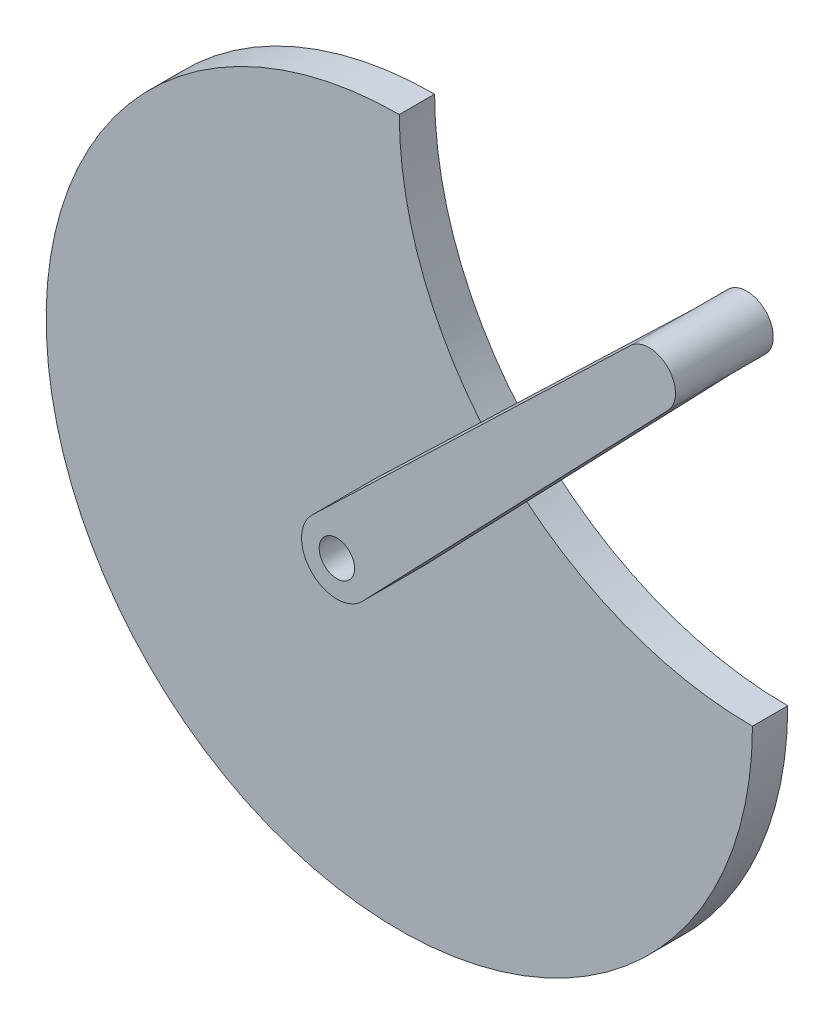
ISO-10303-21;
HEADER;
FILE_DESCRIPTION(('STEP AP214'),'2;1');
FILE_NAME('part.step','',(''),(''),'','','');
FILE_SCHEMA(('AUTOMOTIVE_DESIGN { 1 0 10303 214 1 1 1 1 }'));
ENDSEC;
DATA;
#1=APPLICATION_CONTEXT('core data for automotive mechanical design processes');
#2=APPLICATION_PROTOCOL_DEFINITION('international standard','automotive_design',2000,#1);
#3=PRODUCT_CONTEXT('',#1,'mechanical');
#4=PRODUCT('Part','Part','',(#3));
#5=PRODUCT_RELATED_PRODUCT_CATEGORY('part','',(#4));
#6=PRODUCT_DEFINITION_FORMATION('','',#4);
#7=PRODUCT_DEFINITION_CONTEXT('part definition',#1,'design');
#8=PRODUCT_DEFINITION('design','',#6,#7);
#9=PRODUCT_DEFINITION_SHAPE('','',#8);
#10=(LENGTH_UNIT() NAMED_UNIT(*) SI_UNIT(.MILLI.,.METRE.));
#11=(NAMED_UNIT(*) PLANE_ANGLE_UNIT() SI_UNIT($,.RADIAN.));
#12=(NAMED_UNIT(*) SI_UNIT($,.STERADIAN.) SOLID_ANGLE_UNIT());
#13=UNCERTAINTY_MEASURE_WITH_UNIT(LENGTH_MEASURE(1.E-05),#10,'distance_accuracy_value','');
#14=(GEOMETRIC_REPRESENTATION_CONTEXT(3) GLOBAL_UNCERTAINTY_ASSIGNED_CONTEXT((#13)) GLOBAL_UNIT_ASSIGNED_CONTEXT((#10,
#11,#12)) REPRESENTATION_CONTEXT('',''));
#15=CARTESIAN_POINT('',(0.,0.,0.));
#16=DIRECTION('',(0.,0.,1.));
#17=DIRECTION('',(1.,0.,0.));
#18=AXIS2_PLACEMENT_3D('',#15,#16,#17);
#19=CARTESIAN_POINT('',(-7.81766235091372,10.1823376490863,-1.01823376490863));
#20=DIRECTION('',(0.,0.,1.));
#21=DIRECTION('',(1.,0.,0.));
#22=AXIS2_PLACEMENT_3D('',#19,#20,#21);
#23=CYLINDRICAL_SURFACE('',#22,10.1823376490863);
#24=CARTESIAN_POINT('',(-7.81766235091372,10.1823376490863,0.));
#25=DIRECTION('',(0.,0.,1.));
#26=DIRECTION('',(1.,0.,0.));
#27=AXIS2_PLACEMENT_3D('',#24,#25,#26);
#28=CIRCLE('',#27,10.1823376490863);
#29=CARTESIAN_POINT('',(-7.81766235091371,0.,0.));
#30=VERTEX_POINT('',#29);
#31=CARTESIAN_POINT('',(-14.3274804750982,2.35276116053727,0.));
#32=VERTEX_POINT('',#31);
#33=EDGE_CURVE('E243',#30,#32,#28,.F.);
#34=ORIENTED_EDGE('',*,*,#33,.F.);
#35=DIRECTION('',(0.,0.,1.));
#36=VECTOR('',#35,1.);
#37=CARTESIAN_POINT('',(-7.81766235091371,0.,-1.01823376490863));
#38=LINE('',#37,#36);
#39=CARTESIAN_POINT('',(-7.81766235091371,0.,-1.01823376490863));
#40=VERTEX_POINT('',#39);
#41=EDGE_CURVE('E52',#40,#30,#38,.T.);
#42=ORIENTED_EDGE('',*,*,#41,.F.);
#43=CARTESIAN_POINT('',(-7.81766235091372,10.1823376490863,-1.01823376490863));
#44=DIRECTION('',(0.,0.,1.));
#45=DIRECTION('',(1.,0.,0.));
#46=AXIS2_PLACEMENT_3D('',#43,#44,#45);
#47=CIRCLE('',#46,10.1823376490863);
#48=CARTESIAN_POINT('',(-18.,10.1823376490863,-1.01823376490863));
#49=VERTEX_POINT('',#48);
#50=EDGE_CURVE('E233',#40,#49,#47,.F.);
#51=ORIENTED_EDGE('',*,*,#50,.T.);
#52=DIRECTION('',(0.,0.,1.));
#53=VECTOR('',#52,1.);
#54=CARTESIAN_POINT('',(-18.,10.1823376490863,-1.01823376490863));
#55=LINE('',#54,#53);
#56=CARTESIAN_POINT('',(-18.,10.1823376490863,0.));
#57=VERTEX_POINT('',#56);
#58=EDGE_CURVE('E47',#49,#57,#55,.T.);
#59=ORIENTED_EDGE('',*,*,#58,.T.);
#60=CARTESIAN_POINT('',(-15.6472388394627,3.67251952490181,0.));
#61=VERTEX_POINT('',#60);
#62=EDGE_CURVE('E232',#61,#57,#28,.F.);
#63=ORIENTED_EDGE('',*,*,#62,.F.);
#64=EDGE_CURVE('E245',#32,#61,#28,.F.);
#65=ORIENTED_EDGE('',*,*,#64,.F.);
#66=EDGE_LOOP('',(#34,#42,#51,#59,#63,#65));
#67=FACE_BOUND('',#66,.T.);
#68=ADVANCED_FACE('F44',(#67),#23,.F.);
#69=CARTESIAN_POINT('',(-18.,0.,-1.01823376490863));
#70=DIRECTION('',(0.,0.,1.));
#71=DIRECTION('',(1.,0.,0.));
#72=AXIS2_PLACEMENT_3D('',#69,#70,#71);
#73=CYLINDRICAL_SURFACE('',#72,10.1823376490863);
#74=CARTESIAN_POINT('',(-18.,0.,0.));
#75=DIRECTION('',(0.,0.,1.));
#76=DIRECTION('',(1.,0.,0.));
#77=AXIS2_PLACEMENT_3D('',#74,#75,#76);
#78=CIRCLE('',#77,10.1823376490863);
#79=EDGE_CURVE('E237',#57,#30,#78,.T.);
#80=ORIENTED_EDGE('',*,*,#79,.F.);
#81=ORIENTED_EDGE('',*,*,#58,.F.);
#82=CARTESIAN_POINT('',(-18.,0.,-1.01823376490863));
#83=DIRECTION('',(0.,0.,1.));
#84=DIRECTION('',(1.,0.,0.));
#85=AXIS2_PLACEMENT_3D('',#82,#83,#84);
#86=CIRCLE('',#85,10.1823376490863);
#87=EDGE_CURVE('E236',#49,#40,#86,.T.);
#88=ORIENTED_EDGE('',*,*,#87,.T.);
#89=ORIENTED_EDGE('',*,*,#41,.T.);
#90=EDGE_LOOP('',(#80,#81,#88,#89));
#91=FACE_BOUND('',#90,.T.);
#92=ADVANCED_FACE('F257',(#91),#73,.T.);
#93=CARTESIAN_POINT('',(-18.,0.,-1.01823376490863));
#94=DIRECTION('',(0.,0.,1.));
#95=DIRECTION('',(1.,0.,0.));
#96=AXIS2_PLACEMENT_3D('',#93,#94,#95);
#97=CYLINDRICAL_SURFACE('',#96,0.509116882454314);
#98=CARTESIAN_POINT('',(-18.,0.,-1.01823376490863));
#99=DIRECTION('',(0.,0.,1.));
#100=DIRECTION('',(1.,0.,0.));
#101=AXIS2_PLACEMENT_3D('',#98,#99,#100);
#102=CIRCLE('',#101,0.509116882454314);
#103=CARTESIAN_POINT('',(-17.4908831175457,0.,-1.01823376490863));
#104=VERTEX_POINT('',#103);
#105=EDGE_CURVE('E240',#104,#104,#102,.T.);
#106=ORIENTED_EDGE('',*,*,#105,.F.);
#107=EDGE_LOOP('',(#106));
#108=FACE_BOUND('',#107,.T.);
#109=CARTESIAN_POINT('',(-18.,0.,1.8));
#110=DIRECTION('',(0.,0.,1.));
#111=DIRECTION('',(1.,0.,0.));
#112=AXIS2_PLACEMENT_3D('',#109,#110,#111);
#113=CIRCLE('',#112,0.509116882454314);
#114=CARTESIAN_POINT('',(-17.4908831175457,0.,1.8));
#115=VERTEX_POINT('',#114);
#116=EDGE_CURVE('E195',#115,#115,#113,.T.);
#117=ORIENTED_EDGE('',*,*,#116,.T.);
#118=EDGE_LOOP('',(#117));
#119=FACE_BOUND('',#118,.T.);
#120=ADVANCED_FACE('F287',(#108,#119),#97,.F.);
#121=CARTESIAN_POINT('',(0.,0.,-1.01823376490863));
#122=DIRECTION('',(0.,0.,1.));
#123=DIRECTION('',(1.,0.,0.));
#124=AXIS2_PLACEMENT_3D('',#121,#122,#123);
#125=PLANE('',#124);
#126=ORIENTED_EDGE('',*,*,#50,.F.);
#127=ORIENTED_EDGE('',*,*,#87,.F.);
#128=EDGE_LOOP('',(#126,#127));
#129=FACE_BOUND('',#128,.T.);
#130=ORIENTED_EDGE('',*,*,#105,.T.);
#131=EDGE_LOOP('',(#130));
#132=FACE_BOUND('',#131,.T.);
#133=ADVANCED_FACE('F289',(#129,#132),#125,.F.);
#134=CARTESIAN_POINT('',(0.,0.,0.));
#135=DIRECTION('',(0.,0.,1.));
#136=DIRECTION('',(1.,0.,0.));
#137=AXIS2_PLACEMENT_3D('',#134,#135,#136);
#138=PLANE('',#137);
#139=DIRECTION('',(-0.721107481309078,-0.692823210061613,0.));
#140=VECTOR('',#139,1.);
#141=CARTESIAN_POINT('',(-9.5290919891978,9.55069198919783,0.));
#142=LINE('',#141,#140);
#143=CARTESIAN_POINT('',(-18.7054559855971,0.734255985597119,0.));
#144=VERTEX_POINT('',#143);
#145=EDGE_CURVE('E12',#61,#144,#142,.T.);
#146=ORIENTED_EDGE('',*,*,#145,.F.);
#147=ORIENTED_EDGE('',*,*,#62,.T.);
#148=ORIENTED_EDGE('',*,*,#79,.T.);
#149=ORIENTED_EDGE('',*,*,#33,.T.);
#150=DIRECTION('',(0.692823210061616,0.721107481309075,0.));
#151=VECTOR('',#150,1.);
#152=CARTESIAN_POINT('',(-17.2657440144029,-0.705455985597122,0.));
#153=LINE('',#152,#151);
#154=CARTESIAN_POINT('',(-17.2657440144029,-0.705455985597122,0.));
#155=VERTEX_POINT('',#154);
#156=EDGE_CURVE('E217',#155,#32,#153,.T.);
#157=ORIENTED_EDGE('',*,*,#156,.F.);
#158=CARTESIAN_POINT('',(-18.,0.,0.));
#159=DIRECTION('',(0.,0.,1.));
#160=DIRECTION('',(1.,0.,0.));
#161=AXIS2_PLACEMENT_3D('',#158,#159,#160);
#162=CIRCLE('',#161,1.01823376490863);
#163=EDGE_CURVE('E69',#144,#155,#162,.T.);
#164=ORIENTED_EDGE('',*,*,#163,.F.);
#165=EDGE_LOOP('',(#146,#147,#148,#149,#157,#164));
#166=FACE_BOUND('',#165,.T.);
#167=ADVANCED_FACE('F258',(#166),#138,.T.);
#168=CARTESIAN_POINT('',(-18.,0.,0.));
#169=DIRECTION('',(0.,0.,1.));
#170=DIRECTION('',(1.,0.,0.));
#171=AXIS2_PLACEMENT_3D('',#168,#169,#170);
#172=PLANE('',#171);
#173=CARTESIAN_POINT('',(-9.5290919891978,9.55069198919784,0.));
#174=VERTEX_POINT('',#173);
#175=EDGE_CURVE('E54',#174,#61,#142,.T.);
#176=ORIENTED_EDGE('',*,*,#175,.F.);
#177=CARTESIAN_POINT('',(-8.99999999999997,8.99999999999999,0.));
#178=DIRECTION('',(0.,0.,1.));
#179=DIRECTION('',(1.,0.,0.));
#180=AXIS2_PLACEMENT_3D('',#177,#178,#179);
#181=CIRCLE('',#180,0.763675323681471);
#182=CARTESIAN_POINT('',(-8.44930801080213,8.47090801080215,0.));
#183=VERTEX_POINT('',#182);
#184=EDGE_CURVE('E160',#174,#183,#181,.T.);
#185=ORIENTED_EDGE('',*,*,#184,.T.);
#186=EDGE_CURVE('E216',#32,#183,#153,.T.);
#187=ORIENTED_EDGE('',*,*,#186,.F.);
#188=ORIENTED_EDGE('',*,*,#64,.T.);
#189=EDGE_LOOP('',(#176,#185,#187,#188));
#190=FACE_BOUND('',#189,.T.);
#191=ADVANCED_FACE('F262',(#190),#172,.F.);
#192=CARTESIAN_POINT('',(-18.,0.,1.8));
#193=DIRECTION('',(0.,0.,1.));
#194=DIRECTION('',(1.,0.,0.));
#195=AXIS2_PLACEMENT_3D('',#192,#193,#194);
#196=PLANE('',#195);
#197=CARTESIAN_POINT('',(-18.,0.,1.8));
#198=DIRECTION('',(0.,0.,1.));
#199=DIRECTION('',(1.,0.,0.));
#200=AXIS2_PLACEMENT_3D('',#197,#198,#199);
#201=CIRCLE('',#200,1.01823376490863);
#202=CARTESIAN_POINT('',(-18.7054559855971,0.734255985597119,1.8));
#203=VERTEX_POINT('',#202);
#204=CARTESIAN_POINT('',(-17.2657440144029,-0.705455985597122,1.8));
#205=VERTEX_POINT('',#204);
#206=EDGE_CURVE('E205',#203,#205,#201,.T.);
#207=ORIENTED_EDGE('',*,*,#206,.T.);
#208=DIRECTION('',(0.692823210061616,0.721107481309075,0.));
#209=VECTOR('',#208,1.);
#210=CARTESIAN_POINT('',(-17.2657440144029,-0.705455985597122,1.8));
#211=LINE('',#210,#209);
#212=CARTESIAN_POINT('',(-8.44930801080213,8.47090801080215,1.8));
#213=VERTEX_POINT('',#212);
#214=EDGE_CURVE('E208',#205,#213,#211,.T.);
#215=ORIENTED_EDGE('',*,*,#214,.T.);
#216=CARTESIAN_POINT('',(-8.99999999999997,8.99999999999999,1.8));
#217=DIRECTION('',(0.,0.,1.));
#218=DIRECTION('',(1.,0.,0.));
#219=AXIS2_PLACEMENT_3D('',#216,#217,#218);
#220=CIRCLE('',#219,0.763675323681471);
#221=CARTESIAN_POINT('',(-9.5290919891978,9.55069198919784,1.8));
#222=VERTEX_POINT('',#221);
#223=EDGE_CURVE('E210',#213,#222,#220,.T.);
#224=ORIENTED_EDGE('',*,*,#223,.T.);
#225=DIRECTION('',(-0.721107481309078,-0.692823210061613,0.));
#226=VECTOR('',#225,1.);
#227=CARTESIAN_POINT('',(-9.5290919891978,9.55069198919783,1.8));
#228=LINE('',#227,#226);
#229=EDGE_CURVE('E212',#222,#203,#228,.T.);
#230=ORIENTED_EDGE('',*,*,#229,.T.);
#231=EDGE_LOOP('',(#207,#215,#224,#230));
#232=FACE_BOUND('',#231,.T.);
#233=ORIENTED_EDGE('',*,*,#116,.F.);
#234=EDGE_LOOP('',(#233));
#235=FACE_BOUND('',#234,.T.);
#236=ADVANCED_FACE('F281',(#232,#235),#196,.T.);
#237=CARTESIAN_POINT('',(-18.,0.,1.8));
#238=DIRECTION('',(0.,0.,-1.));
#239=DIRECTION('',(-1.,0.,0.));
#240=AXIS2_PLACEMENT_3D('',#237,#238,#239);
#241=CYLINDRICAL_SURFACE('',#240,1.01823376490863);
#242=ORIENTED_EDGE('',*,*,#163,.T.);
#243=DIRECTION('',(0.,0.,-1.));
#244=VECTOR('',#243,1.);
#245=CARTESIAN_POINT('',(-17.2657440144029,-0.705455985597122,1.8));
#246=LINE('',#245,#244);
#247=EDGE_CURVE('E229',#205,#155,#246,.T.);
#248=ORIENTED_EDGE('',*,*,#247,.F.);
#249=ORIENTED_EDGE('',*,*,#206,.F.);
#250=DIRECTION('',(0.,0.,-1.));
#251=VECTOR('',#250,1.);
#252=CARTESIAN_POINT('',(-18.7054559855971,0.734255985597119,1.8));
#253=LINE('',#252,#251);
#254=EDGE_CURVE('E214',#203,#144,#253,.T.);
#255=ORIENTED_EDGE('',*,*,#254,.T.);
#256=EDGE_LOOP('',(#242,#248,#249,#255));
#257=FACE_BOUND('',#256,.T.);
#258=ADVANCED_FACE('F279',(#257),#241,.T.);
#259=CARTESIAN_POINT('',(-17.2657440144029,-0.705455985597122,1.8));
#260=DIRECTION('',(-0.721107481309075,0.692823210061616,0.));
#261=DIRECTION('',(-0.692823210061616,-0.721107481309075,0.));
#262=AXIS2_PLACEMENT_3D('',#259,#260,#261);
#263=PLANE('',#262);
#264=ORIENTED_EDGE('',*,*,#156,.T.);
#265=ORIENTED_EDGE('',*,*,#186,.T.);
#266=DIRECTION('',(0.,0.,-1.));
#267=VECTOR('',#266,1.);
#268=CARTESIAN_POINT('',(-8.44930801080213,8.47090801080215,1.8));
#269=LINE('',#268,#267);
#270=EDGE_CURVE('E226',#213,#183,#269,.T.);
#271=ORIENTED_EDGE('',*,*,#270,.F.);
#272=ORIENTED_EDGE('',*,*,#214,.F.);
#273=ORIENTED_EDGE('',*,*,#247,.T.);
#274=EDGE_LOOP('',(#264,#265,#271,#272,#273));
#275=FACE_BOUND('',#274,.T.);
#276=ADVANCED_FACE('F275',(#275),#263,.F.);
#277=CARTESIAN_POINT('',(-8.99999999999997,8.99999999999999,1.8));
#278=DIRECTION('',(0.,0.,-1.));
#279=DIRECTION('',(-1.,0.,0.));
#280=AXIS2_PLACEMENT_3D('',#277,#278,#279);
#281=CYLINDRICAL_SURFACE('',#280,0.763675323681471);
#282=ORIENTED_EDGE('',*,*,#270,.T.);
#283=ORIENTED_EDGE('',*,*,#184,.F.);
#284=DIRECTION('',(0.,0.,-1.));
#285=VECTOR('',#284,1.);
#286=CARTESIAN_POINT('',(-9.5290919891978,9.55069198919784,1.8));
#287=LINE('',#286,#285);
#288=EDGE_CURVE('E223',#222,#174,#287,.T.);
#289=ORIENTED_EDGE('',*,*,#288,.F.);
#290=ORIENTED_EDGE('',*,*,#223,.F.);
#291=EDGE_LOOP('',(#282,#283,#289,#290));
#292=FACE_BOUND('',#291,.T.);
#293=CARTESIAN_POINT('',(-8.99999999999997,8.99999999999999,-1.01823376490863));
#294=DIRECTION('',(0.,0.,1.));
#295=DIRECTION('',(1.,0.,0.));
#296=AXIS2_PLACEMENT_3D('',#293,#294,#295);
#297=CIRCLE('',#296,0.763675323681471);
#298=CARTESIAN_POINT('',(-8.2363246763185,8.99999999999999,-1.01823376490863));
#299=VERTEX_POINT('',#298);
#300=EDGE_CURVE('E152',#299,#299,#297,.T.);
#301=ORIENTED_EDGE('',*,*,#300,.T.);
#302=EDGE_LOOP('',(#301));
#303=FACE_BOUND('',#302,.T.);
#304=ADVANCED_FACE('F271',(#292,#303),#281,.T.);
#305=CARTESIAN_POINT('',(-9.5290919891978,9.55069198919783,1.8));
#306=DIRECTION('',(0.692823210061613,-0.721107481309078,0.));
#307=DIRECTION('',(0.721107481309078,0.692823210061613,0.));
#308=AXIS2_PLACEMENT_3D('',#305,#306,#307);
#309=PLANE('',#308);
#310=ORIENTED_EDGE('',*,*,#175,.T.);
#311=ORIENTED_EDGE('',*,*,#145,.T.);
#312=ORIENTED_EDGE('',*,*,#254,.F.);
#313=ORIENTED_EDGE('',*,*,#229,.F.);
#314=ORIENTED_EDGE('',*,*,#288,.T.);
#315=EDGE_LOOP('',(#310,#311,#312,#313,#314));
#316=FACE_BOUND('',#315,.T.);
#317=ADVANCED_FACE('F265',(#316),#309,.F.);
#318=CARTESIAN_POINT('',(0.36,0.359999999999999,-1.01823376490863));
#319=DIRECTION('',(0.707106781186549,0.707106781186546,0.));
#320=DIRECTION('',(-0.707106781186546,0.707106781186549,0.));
#321=AXIS2_PLACEMENT_3D('',#318,#319,#320);
#322=PLANE('',#321);
#323=DIRECTION('',(-0.707106781186546,0.707106781186549,0.));
#324=VECTOR('',#323,1.);
#325=CARTESIAN_POINT('',(0.36,0.359999999999999,0.));
#326=LINE('',#325,#324);
#327=CARTESIAN_POINT('',(-8.63279711769366,9.35279711769369,0.));
#328=VERTEX_POINT('',#327);
#329=CARTESIAN_POINT('',(-8.63999999999996,9.36,0.));
#330=VERTEX_POINT('',#329);
#331=EDGE_CURVE('E182',#328,#330,#326,.T.);
#332=ORIENTED_EDGE('',*,*,#331,.T.);
#333=DIRECTION('',(0.,0.,1.));
#334=VECTOR('',#333,1.);
#335=CARTESIAN_POINT('',(-8.63999999999996,9.36,-1.01823376490863));
#336=LINE('',#335,#334);
#337=CARTESIAN_POINT('',(-8.63999999999996,9.36,-1.01823376490863));
#338=VERTEX_POINT('',#337);
#339=EDGE_CURVE('E158',#338,#330,#336,.T.);
#340=ORIENTED_EDGE('',*,*,#339,.F.);
#341=DIRECTION('',(-0.707106781186546,0.707106781186549,0.));
#342=VECTOR('',#341,1.);
#343=CARTESIAN_POINT('',(0.36,0.359999999999999,-1.01823376490863));
#344=LINE('',#343,#342);
#345=CARTESIAN_POINT('',(-8.63279711769366,9.35279711769369,-1.01823376490863));
#346=VERTEX_POINT('',#345);
#347=EDGE_CURVE('E156',#346,#338,#344,.T.);
#348=ORIENTED_EDGE('',*,*,#347,.F.);
#349=DIRECTION('',(0.,0.,1.));
#350=VECTOR('',#349,1.);
#351=CARTESIAN_POINT('',(-8.63279711769366,9.35279711769369,-1.01823376490863));
#352=LINE('',#351,#350);
#353=EDGE_CURVE('E141',#346,#328,#352,.T.);
#354=ORIENTED_EDGE('',*,*,#353,.T.);
#355=EDGE_LOOP('',(#332,#340,#348,#354));
#356=FACE_BOUND('',#355,.T.);
#357=ADVANCED_FACE('F157',(#356),#322,.F.);
#358=CARTESIAN_POINT('',(-8.99999999999997,8.99999999999999,-1.01823376490863));
#359=DIRECTION('',(0.,0.,1.));
#360=DIRECTION('',(1.,0.,0.));
#361=AXIS2_PLACEMENT_3D('',#358,#359,#360);
#362=CYLINDRICAL_SURFACE('',#361,0.509116882454315);
#363=CARTESIAN_POINT('',(-8.99999999999997,8.99999999999999,0.));
#364=DIRECTION('',(0.,0.,1.));
#365=DIRECTION('',(1.,0.,0.));
#366=AXIS2_PLACEMENT_3D('',#363,#364,#365);
#367=CIRCLE('',#366,0.509116882454315);
#368=CARTESIAN_POINT('',(-9.35999999999997,8.63999999999999,0.));
#369=VERTEX_POINT('',#368);
#370=EDGE_CURVE('E190',#330,#369,#367,.T.);
#371=ORIENTED_EDGE('',*,*,#370,.T.);
#372=DIRECTION('',(0.,0.,1.));
#373=VECTOR('',#372,1.);
#374=CARTESIAN_POINT('',(-9.35999999999997,8.63999999999999,-1.01823376490863));
#375=LINE('',#374,#373);
#376=CARTESIAN_POINT('',(-9.35999999999997,8.63999999999999,-1.01823376490863));
#377=VERTEX_POINT('',#376);
#378=EDGE_CURVE('E196',#377,#369,#375,.T.);
#379=ORIENTED_EDGE('',*,*,#378,.F.);
#380=CARTESIAN_POINT('',(-8.99999999999997,8.99999999999999,-1.01823376490863));
#381=DIRECTION('',(0.,0.,1.));
#382=DIRECTION('',(1.,0.,0.));
#383=AXIS2_PLACEMENT_3D('',#380,#381,#382);
#384=CIRCLE('',#383,0.509116882454315);
#385=EDGE_CURVE('E174',#338,#377,#384,.T.);
#386=ORIENTED_EDGE('',*,*,#385,.F.);
#387=ORIENTED_EDGE('',*,*,#339,.T.);
#388=EDGE_LOOP('',(#371,#379,#386,#387));
#389=FACE_BOUND('',#388,.T.);
#390=ADVANCED_FACE('F364',(#389),#362,.F.);
#391=CARTESIAN_POINT('',(-0.360000000000001,-0.36,-1.01823376490863));
#392=DIRECTION('',(0.707106781186549,0.707106781186546,0.));
#393=DIRECTION('',(-0.707106781186546,0.707106781186549,0.));
#394=AXIS2_PLACEMENT_3D('',#391,#392,#393);
#395=PLANE('',#394);
#396=DIRECTION('',(-0.707106781186546,0.707106781186549,0.));
#397=VECTOR('',#396,1.);
#398=CARTESIAN_POINT('',(-0.360000000000001,-0.36,0.));
#399=LINE('',#398,#397);
#400=CARTESIAN_POINT('',(-9.35279711769366,8.63279711769369,0.));
#401=VERTEX_POINT('',#400);
#402=EDGE_CURVE('E187',#401,#369,#399,.T.);
#403=ORIENTED_EDGE('',*,*,#402,.F.);
#404=DIRECTION('',(0.,0.,1.));
#405=VECTOR('',#404,1.);
#406=CARTESIAN_POINT('',(-9.35279711769366,8.63279711769369,-1.01823376490863));
#407=LINE('',#406,#405);
#408=CARTESIAN_POINT('',(-9.35279711769366,8.63279711769369,-1.01823376490863));
#409=VERTEX_POINT('',#408);
#410=EDGE_CURVE('E198',#409,#401,#407,.T.);
#411=ORIENTED_EDGE('',*,*,#410,.F.);
#412=DIRECTION('',(-0.707106781186546,0.707106781186549,0.));
#413=VECTOR('',#412,1.);
#414=CARTESIAN_POINT('',(-0.360000000000001,-0.36,-1.01823376490863));
#415=LINE('',#414,#413);
#416=EDGE_CURVE('E171',#409,#377,#415,.T.);
#417=ORIENTED_EDGE('',*,*,#416,.T.);
#418=ORIENTED_EDGE('',*,*,#378,.T.);
#419=EDGE_LOOP('',(#403,#411,#417,#418));
#420=FACE_BOUND('',#419,.T.);
#421=ADVANCED_FACE('F371',(#420),#395,.T.);
#422=CARTESIAN_POINT('',(0.,0.,-1.01823376490863));
#423=DIRECTION('',(0.,0.,1.));
#424=DIRECTION('',(1.,0.,0.));
#425=AXIS2_PLACEMENT_3D('',#422,#423,#424);
#426=CYLINDRICAL_SURFACE('',#425,12.7279220613578);
#427=CARTESIAN_POINT('',(0.,0.,0.));
#428=DIRECTION('',(0.,0.,1.));
#429=DIRECTION('',(1.,0.,0.));
#430=AXIS2_PLACEMENT_3D('',#427,#428,#429);
#431=CIRCLE('',#430,12.7279220613578);
#432=CARTESIAN_POINT('',(-9.35272799279855,8.63287200720142,0.));
#433=VERTEX_POINT('',#432);
#434=EDGE_CURVE('E185',#433,#401,#431,.T.);
#435=ORIENTED_EDGE('',*,*,#434,.F.);
#436=DIRECTION('',(0.,0.,1.));
#437=VECTOR('',#436,1.);
#438=CARTESIAN_POINT('',(-9.35272799279855,8.63287200720142,-1.01823376490863));
#439=LINE('',#438,#437);
#440=CARTESIAN_POINT('',(-9.35272799279855,8.63287200720142,-1.01823376490863));
#441=VERTEX_POINT('',#440);
#442=EDGE_CURVE('E200',#441,#433,#439,.T.);
#443=ORIENTED_EDGE('',*,*,#442,.F.);
#444=CARTESIAN_POINT('',(0.,0.,-1.01823376490863));
#445=DIRECTION('',(0.,0.,1.));
#446=DIRECTION('',(1.,0.,0.));
#447=AXIS2_PLACEMENT_3D('',#444,#445,#446);
#448=CIRCLE('',#447,12.7279220613578);
#449=EDGE_CURVE('E168',#441,#409,#448,.T.);
#450=ORIENTED_EDGE('',*,*,#449,.T.);
#451=ORIENTED_EDGE('',*,*,#410,.T.);
#452=EDGE_LOOP('',(#435,#443,#450,#451));
#453=FACE_BOUND('',#452,.T.);
#454=ADVANCED_FACE('F379',(#453),#426,.T.);
#455=CARTESIAN_POINT('',(-8.99999999999997,8.99999999999999,-1.01823376490863));
#456=DIRECTION('',(0.,0.,1.));
#457=DIRECTION('',(1.,0.,0.));
#458=AXIS2_PLACEMENT_3D('',#455,#456,#457);
#459=CYLINDRICAL_SURFACE('',#458,0.509116882454313);
#460=CARTESIAN_POINT('',(-8.99999999999997,8.99999999999999,0.));
#461=DIRECTION('',(0.,0.,1.));
#462=DIRECTION('',(1.,0.,0.));
#463=AXIS2_PLACEMENT_3D('',#460,#461,#462);
#464=CIRCLE('',#463,0.509116882454313);
#465=CARTESIAN_POINT('',(-8.63287200720139,9.35272799279857,0.));
#466=VERTEX_POINT('',#465);
#467=EDGE_CURVE('E61',#433,#466,#464,.T.);
#468=ORIENTED_EDGE('',*,*,#467,.T.);
#469=DIRECTION('',(0.,0.,1.));
#470=VECTOR('',#469,1.);
#471=CARTESIAN_POINT('',(-8.63287200720139,9.35272799279857,-1.01823376490863));
#472=LINE('',#471,#470);
#473=CARTESIAN_POINT('',(-8.63287200720139,9.35272799279857,-1.01823376490863));
#474=VERTEX_POINT('',#473);
#475=EDGE_CURVE('E151',#474,#466,#472,.T.);
#476=ORIENTED_EDGE('',*,*,#475,.F.);
#477=CARTESIAN_POINT('',(-8.99999999999997,8.99999999999999,-1.01823376490863));
#478=DIRECTION('',(0.,0.,1.));
#479=DIRECTION('',(1.,0.,0.));
#480=AXIS2_PLACEMENT_3D('',#477,#478,#479);
#481=CIRCLE('',#480,0.509116882454313);
#482=EDGE_CURVE('E166',#441,#474,#481,.T.);
#483=ORIENTED_EDGE('',*,*,#482,.F.);
#484=ORIENTED_EDGE('',*,*,#442,.T.);
#485=EDGE_LOOP('',(#468,#476,#483,#484));
#486=FACE_BOUND('',#485,.T.);
#487=ADVANCED_FACE('F386',(#486),#459,.F.);
#488=EDGE_CURVE('E147',#328,#466,#431,.T.);
#489=ORIENTED_EDGE('',*,*,#488,.F.);
#490=ORIENTED_EDGE('',*,*,#353,.F.);
#491=EDGE_CURVE('E145',#346,#474,#448,.T.);
#492=ORIENTED_EDGE('',*,*,#491,.T.);
#493=ORIENTED_EDGE('',*,*,#475,.T.);
#494=EDGE_LOOP('',(#489,#490,#492,#493));
#495=FACE_BOUND('',#494,.T.);
#496=ADVANCED_FACE('F143',(#495),#426,.T.);
#497=CARTESIAN_POINT('',(0.,0.,-1.01823376490863));
#498=DIRECTION('',(0.,0.,1.));
#499=DIRECTION('',(1.,0.,0.));
#500=AXIS2_PLACEMENT_3D('',#497,#498,#499);
#501=PLANE('',#500);
#502=ORIENTED_EDGE('',*,*,#347,.T.);
#503=ORIENTED_EDGE('',*,*,#385,.T.);
#504=ORIENTED_EDGE('',*,*,#416,.F.);
#505=ORIENTED_EDGE('',*,*,#449,.F.);
#506=ORIENTED_EDGE('',*,*,#482,.T.);
#507=ORIENTED_EDGE('',*,*,#491,.F.);
#508=EDGE_LOOP('',(#502,#503,#504,#505,#506,#507));
#509=FACE_BOUND('',#508,.T.);
#510=ORIENTED_EDGE('',*,*,#300,.F.);
#511=EDGE_LOOP('',(#510));
#512=FACE_BOUND('',#511,.T.);
#513=ADVANCED_FACE('F162',(#509,#512),#501,.F.);
#514=ORIENTED_EDGE('',*,*,#331,.F.);
#515=ORIENTED_EDGE('',*,*,#488,.T.);
#516=ORIENTED_EDGE('',*,*,#467,.F.);
#517=ORIENTED_EDGE('',*,*,#434,.T.);
#518=ORIENTED_EDGE('',*,*,#402,.T.);
#519=ORIENTED_EDGE('',*,*,#370,.F.);
#520=EDGE_LOOP('',(#514,#515,#516,#517,#518,#519));
#521=FACE_BOUND('',#520,.T.);
#522=ADVANCED_FACE('F329',(#521),#172,.F.);
#523=CLOSED_SHELL('',(#68,#92,#120,#133,#167,#191,#236,#258,#276,#304,#317,#357,#390,#421,#454,
#487,#496,#513,#522));
#524=MANIFOLD_SOLID_BREP('B2',#523);
#525=ADVANCED_BREP_SHAPE_REPRESENTATION('',(#18,#524),#14);
#526=SHAPE_DEFINITION_REPRESENTATION(#9,#525);
ENDSEC;
END-ISO-10303-21;
